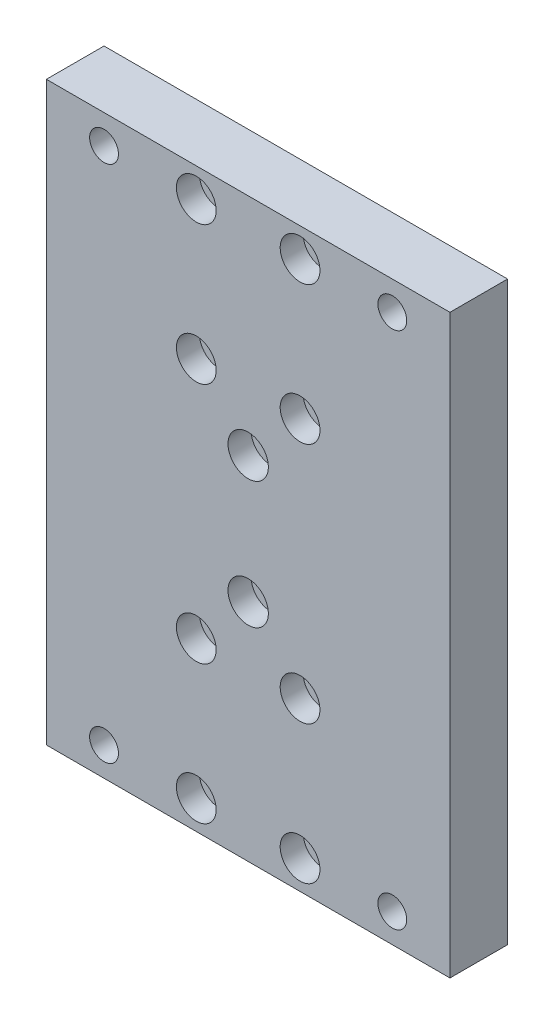
ISO-10303-21;
HEADER;
FILE_DESCRIPTION(('STEP AP214'),'2;1');
FILE_NAME('part.step','',(''),(''),'','','');
FILE_SCHEMA(('AUTOMOTIVE_DESIGN { 1 0 10303 214 1 1 1 1 }'));
ENDSEC;
DATA;
#1=APPLICATION_CONTEXT('core data for automotive mechanical design processes');
#2=APPLICATION_PROTOCOL_DEFINITION('international standard','automotive_design',2000,#1);
#3=PRODUCT_CONTEXT('',#1,'mechanical');
#4=PRODUCT('Part','Part','',(#3));
#5=PRODUCT_RELATED_PRODUCT_CATEGORY('part','',(#4));
#6=PRODUCT_DEFINITION_FORMATION('','',#4);
#7=PRODUCT_DEFINITION_CONTEXT('part definition',#1,'design');
#8=PRODUCT_DEFINITION('design','',#6,#7);
#9=PRODUCT_DEFINITION_SHAPE('','',#8);
#10=(LENGTH_UNIT() NAMED_UNIT(*) SI_UNIT(.MILLI.,.METRE.));
#11=(NAMED_UNIT(*) PLANE_ANGLE_UNIT() SI_UNIT($,.RADIAN.));
#12=(NAMED_UNIT(*) SI_UNIT($,.STERADIAN.) SOLID_ANGLE_UNIT());
#13=UNCERTAINTY_MEASURE_WITH_UNIT(LENGTH_MEASURE(1.E-05),#10,'distance_accuracy_value','');
#14=(GEOMETRIC_REPRESENTATION_CONTEXT(3) GLOBAL_UNCERTAINTY_ASSIGNED_CONTEXT((#13)) GLOBAL_UNIT_ASSIGNED_CONTEXT((#10,
#11,#12)) REPRESENTATION_CONTEXT('',''));
#15=CARTESIAN_POINT('',(0.,0.,0.));
#16=DIRECTION('',(0.,0.,1.));
#17=DIRECTION('',(1.,0.,0.));
#18=AXIS2_PLACEMENT_3D('',#15,#16,#17);
#19=CARTESIAN_POINT('',(0.,11.,0.));
#20=DIRECTION('',(0.,0.,1.));
#21=DIRECTION('',(1.,0.,0.));
#22=AXIS2_PLACEMENT_3D('',#19,#20,#21);
#23=CYLINDRICAL_SURFACE('',#22,2.);
#24=CARTESIAN_POINT('',(0.,11.,0.));
#25=DIRECTION('',(0.,0.,1.));
#26=DIRECTION('',(1.,0.,0.));
#27=AXIS2_PLACEMENT_3D('',#24,#25,#26);
#28=CIRCLE('',#27,2.);
#29=CARTESIAN_POINT('',(2.00000000000004,11.,0.));
#30=VERTEX_POINT('',#29);
#31=EDGE_CURVE('E143',#30,#30,#28,.T.);
#32=ORIENTED_EDGE('',*,*,#31,.F.);
#33=EDGE_LOOP('',(#32));
#34=FACE_BOUND('',#33,.T.);
#35=CARTESIAN_POINT('',(0.,11.,6.));
#36=DIRECTION('',(0.,0.,1.));
#37=DIRECTION('',(1.,0.,0.));
#38=AXIS2_PLACEMENT_3D('',#35,#36,#37);
#39=CIRCLE('',#38,2.);
#40=CARTESIAN_POINT('',(2.00000000000004,11.,6.));
#41=VERTEX_POINT('',#40);
#42=EDGE_CURVE('E40',#41,#41,#39,.F.);
#43=ORIENTED_EDGE('',*,*,#42,.F.);
#44=EDGE_LOOP('',(#43));
#45=FACE_BOUND('',#44,.T.);
#46=ADVANCED_FACE('F36',(#34,#45),#23,.F.);
#47=CARTESIAN_POINT('',(0.,-11.,0.));
#48=DIRECTION('',(0.,0.,1.));
#49=DIRECTION('',(1.,0.,0.));
#50=AXIS2_PLACEMENT_3D('',#47,#48,#49);
#51=CYLINDRICAL_SURFACE('',#50,2.);
#52=CARTESIAN_POINT('',(0.,-11.,0.));
#53=DIRECTION('',(0.,0.,1.));
#54=DIRECTION('',(1.,0.,0.));
#55=AXIS2_PLACEMENT_3D('',#52,#53,#54);
#56=CIRCLE('',#55,2.);
#57=CARTESIAN_POINT('',(1.99999999999997,-11.,0.));
#58=VERTEX_POINT('',#57);
#59=EDGE_CURVE('E158',#58,#58,#56,.T.);
#60=ORIENTED_EDGE('',*,*,#59,.F.);
#61=EDGE_LOOP('',(#60));
#62=FACE_BOUND('',#61,.T.);
#63=CARTESIAN_POINT('',(0.,-11.,6.));
#64=DIRECTION('',(0.,0.,1.));
#65=DIRECTION('',(1.,0.,0.));
#66=AXIS2_PLACEMENT_3D('',#63,#64,#65);
#67=CIRCLE('',#66,2.);
#68=CARTESIAN_POINT('',(1.99999999999997,-11.,6.));
#69=VERTEX_POINT('',#68);
#70=EDGE_CURVE('E137',#69,#69,#67,.F.);
#71=ORIENTED_EDGE('',*,*,#70,.F.);
#72=EDGE_LOOP('',(#71));
#73=FACE_BOUND('',#72,.T.);
#74=ADVANCED_FACE('F278',(#62,#73),#51,.F.);
#75=CARTESIAN_POINT('',(-9.00000000000006,-20.9999999999998,10.));
#76=DIRECTION('',(0.,0.,-1.));
#77=DIRECTION('',(-1.,0.,0.));
#78=AXIS2_PLACEMENT_3D('',#75,#76,#77);
#79=CYLINDRICAL_SURFACE('',#78,1.5);
#80=CARTESIAN_POINT('',(-9.00000000000006,-20.9999999999998,0.));
#81=DIRECTION('',(0.,0.,-1.));
#82=DIRECTION('',(-1.,0.,0.));
#83=AXIS2_PLACEMENT_3D('',#80,#81,#82);
#84=CIRCLE('',#83,1.5);
#85=CARTESIAN_POINT('',(-10.5000000000001,-20.9999999999998,0.));
#86=VERTEX_POINT('',#85);
#87=EDGE_CURVE('E213',#86,#86,#84,.T.);
#88=ORIENTED_EDGE('',*,*,#87,.T.);
#89=EDGE_LOOP('',(#88));
#90=FACE_BOUND('',#89,.T.);
#91=CARTESIAN_POINT('',(-9.00000000000006,-20.9999999999998,6.));
#92=DIRECTION('',(0.,0.,1.));
#93=DIRECTION('',(1.,0.,0.));
#94=AXIS2_PLACEMENT_3D('',#91,#92,#93);
#95=CIRCLE('',#94,1.5);
#96=CARTESIAN_POINT('',(-7.50000000000006,-20.9999999999998,6.));
#97=VERTEX_POINT('',#96);
#98=EDGE_CURVE('E131',#97,#97,#95,.F.);
#99=ORIENTED_EDGE('',*,*,#98,.F.);
#100=EDGE_LOOP('',(#99));
#101=FACE_BOUND('',#100,.T.);
#102=ADVANCED_FACE('F285',(#90,#101),#79,.F.);
#103=CARTESIAN_POINT('',(8.99999999999985,-44.9999999999998,10.));
#104=DIRECTION('',(0.,0.,-1.));
#105=DIRECTION('',(-1.,0.,0.));
#106=AXIS2_PLACEMENT_3D('',#103,#104,#105);
#107=CYLINDRICAL_SURFACE('',#106,1.5);
#108=CARTESIAN_POINT('',(8.99999999999985,-44.9999999999998,0.));
#109=DIRECTION('',(0.,0.,-1.));
#110=DIRECTION('',(-1.,0.,0.));
#111=AXIS2_PLACEMENT_3D('',#108,#109,#110);
#112=CIRCLE('',#111,1.5);
#113=CARTESIAN_POINT('',(7.49999999999985,-44.9999999999998,0.));
#114=VERTEX_POINT('',#113);
#115=EDGE_CURVE('E212',#114,#114,#112,.T.);
#116=ORIENTED_EDGE('',*,*,#115,.T.);
#117=EDGE_LOOP('',(#116));
#118=FACE_BOUND('',#117,.T.);
#119=CARTESIAN_POINT('',(8.99999999999985,-44.9999999999998,6.));
#120=DIRECTION('',(0.,0.,1.));
#121=DIRECTION('',(1.,0.,0.));
#122=AXIS2_PLACEMENT_3D('',#119,#120,#121);
#123=CIRCLE('',#122,1.5);
#124=CARTESIAN_POINT('',(10.4999999999998,-44.9999999999998,6.));
#125=VERTEX_POINT('',#124);
#126=EDGE_CURVE('E128',#125,#125,#123,.F.);
#127=ORIENTED_EDGE('',*,*,#126,.F.);
#128=EDGE_LOOP('',(#127));
#129=FACE_BOUND('',#128,.T.);
#130=ADVANCED_FACE('F366',(#118,#129),#107,.F.);
#131=CARTESIAN_POINT('',(-8.99999999999984,45.0000000000002,10.));
#132=DIRECTION('',(0.,0.,-1.));
#133=DIRECTION('',(-1.,0.,0.));
#134=AXIS2_PLACEMENT_3D('',#131,#132,#133);
#135=CYLINDRICAL_SURFACE('',#134,1.5);
#136=CARTESIAN_POINT('',(-8.99999999999984,45.0000000000002,0.));
#137=DIRECTION('',(0.,0.,-1.));
#138=DIRECTION('',(-1.,0.,0.));
#139=AXIS2_PLACEMENT_3D('',#136,#137,#138);
#140=CIRCLE('',#139,1.5);
#141=CARTESIAN_POINT('',(-10.4999999999998,45.0000000000002,0.));
#142=VERTEX_POINT('',#141);
#143=EDGE_CURVE('E225',#142,#142,#140,.T.);
#144=ORIENTED_EDGE('',*,*,#143,.T.);
#145=EDGE_LOOP('',(#144));
#146=FACE_BOUND('',#145,.T.);
#147=CARTESIAN_POINT('',(-8.99999999999984,45.0000000000002,6.));
#148=DIRECTION('',(0.,0.,1.));
#149=DIRECTION('',(1.,0.,0.));
#150=AXIS2_PLACEMENT_3D('',#147,#148,#149);
#151=CIRCLE('',#150,1.5);
#152=CARTESIAN_POINT('',(-7.49999999999983,45.0000000000002,6.));
#153=VERTEX_POINT('',#152);
#154=EDGE_CURVE('E122',#153,#153,#151,.F.);
#155=ORIENTED_EDGE('',*,*,#154,.F.);
#156=EDGE_LOOP('',(#155));
#157=FACE_BOUND('',#156,.T.);
#158=ADVANCED_FACE('F370',(#146,#157),#135,.F.);
#159=CARTESIAN_POINT('',(9.00000000000008,21.0000000000002,10.));
#160=DIRECTION('',(0.,0.,-1.));
#161=DIRECTION('',(-1.,0.,0.));
#162=AXIS2_PLACEMENT_3D('',#159,#160,#161);
#163=CYLINDRICAL_SURFACE('',#162,1.5);
#164=CARTESIAN_POINT('',(9.00000000000008,21.0000000000002,0.));
#165=DIRECTION('',(0.,0.,-1.));
#166=DIRECTION('',(-1.,0.,0.));
#167=AXIS2_PLACEMENT_3D('',#164,#165,#166);
#168=CIRCLE('',#167,1.5);
#169=CARTESIAN_POINT('',(7.50000000000007,21.0000000000002,0.));
#170=VERTEX_POINT('',#169);
#171=EDGE_CURVE('E222',#170,#170,#168,.T.);
#172=ORIENTED_EDGE('',*,*,#171,.T.);
#173=EDGE_LOOP('',(#172));
#174=FACE_BOUND('',#173,.T.);
#175=CARTESIAN_POINT('',(9.00000000000008,21.0000000000002,6.));
#176=DIRECTION('',(0.,0.,1.));
#177=DIRECTION('',(1.,0.,0.));
#178=AXIS2_PLACEMENT_3D('',#175,#176,#177);
#179=CIRCLE('',#178,1.5);
#180=CARTESIAN_POINT('',(10.5000000000001,21.0000000000002,6.));
#181=VERTEX_POINT('',#180);
#182=EDGE_CURVE('E119',#181,#181,#179,.F.);
#183=ORIENTED_EDGE('',*,*,#182,.F.);
#184=EDGE_LOOP('',(#183));
#185=FACE_BOUND('',#184,.T.);
#186=ADVANCED_FACE('F380',(#174,#185),#163,.F.);
#187=CARTESIAN_POINT('',(-35.,-50.,10.));
#188=DIRECTION('',(1.,0.,0.));
#189=DIRECTION('',(0.,0.,-1.));
#190=AXIS2_PLACEMENT_3D('',#187,#188,#189);
#191=PLANE('',#190);
#192=DIRECTION('',(0.,-1.,0.));
#193=VECTOR('',#192,1.);
#194=CARTESIAN_POINT('',(-35.,-50.,0.));
#195=LINE('',#194,#193);
#196=CARTESIAN_POINT('',(-35.,50.,0.));
#197=VERTEX_POINT('',#196);
#198=CARTESIAN_POINT('',(-35.,-50.,0.));
#199=VERTEX_POINT('',#198);
#200=EDGE_CURVE('E103',#197,#199,#195,.T.);
#201=ORIENTED_EDGE('',*,*,#200,.T.);
#202=DIRECTION('',(0.,0.,-1.));
#203=VECTOR('',#202,1.);
#204=CARTESIAN_POINT('',(-35.,-50.,10.));
#205=LINE('',#204,#203);
#206=CARTESIAN_POINT('',(-35.,-50.,10.));
#207=VERTEX_POINT('',#206);
#208=EDGE_CURVE('E11',#207,#199,#205,.T.);
#209=ORIENTED_EDGE('',*,*,#208,.F.);
#210=DIRECTION('',(0.,-1.,0.));
#211=VECTOR('',#210,1.);
#212=CARTESIAN_POINT('',(-35.,-50.,10.));
#213=LINE('',#212,#211);
#214=CARTESIAN_POINT('',(-35.,50.,10.));
#215=VERTEX_POINT('',#214);
#216=EDGE_CURVE('E90',#215,#207,#213,.T.);
#217=ORIENTED_EDGE('',*,*,#216,.F.);
#218=DIRECTION('',(0.,0.,-1.));
#219=VECTOR('',#218,1.);
#220=CARTESIAN_POINT('',(-35.,50.,10.));
#221=LINE('',#220,#219);
#222=EDGE_CURVE('E99',#215,#197,#221,.T.);
#223=ORIENTED_EDGE('',*,*,#222,.T.);
#224=EDGE_LOOP('',(#201,#209,#217,#223));
#225=FACE_BOUND('',#224,.T.);
#226=ADVANCED_FACE('F38',(#225),#191,.F.);
#227=CARTESIAN_POINT('',(35.,-50.,10.));
#228=DIRECTION('',(0.,1.,0.));
#229=DIRECTION('',(-1.,0.,0.));
#230=AXIS2_PLACEMENT_3D('',#227,#228,#229);
#231=PLANE('',#230);
#232=DIRECTION('',(1.,0.,0.));
#233=VECTOR('',#232,1.);
#234=CARTESIAN_POINT('',(35.,-50.,0.));
#235=LINE('',#234,#233);
#236=CARTESIAN_POINT('',(35.,-50.,0.));
#237=VERTEX_POINT('',#236);
#238=EDGE_CURVE('E94',#199,#237,#235,.T.);
#239=ORIENTED_EDGE('',*,*,#238,.T.);
#240=DIRECTION('',(0.,0.,-1.));
#241=VECTOR('',#240,1.);
#242=CARTESIAN_POINT('',(35.,-50.,10.));
#243=LINE('',#242,#241);
#244=CARTESIAN_POINT('',(35.,-50.,10.));
#245=VERTEX_POINT('',#244);
#246=EDGE_CURVE('E46',#245,#237,#243,.T.);
#247=ORIENTED_EDGE('',*,*,#246,.F.);
#248=DIRECTION('',(1.,0.,0.));
#249=VECTOR('',#248,1.);
#250=CARTESIAN_POINT('',(35.,-50.,10.));
#251=LINE('',#250,#249);
#252=EDGE_CURVE('E85',#207,#245,#251,.T.);
#253=ORIENTED_EDGE('',*,*,#252,.F.);
#254=ORIENTED_EDGE('',*,*,#208,.T.);
#255=EDGE_LOOP('',(#239,#247,#253,#254));
#256=FACE_BOUND('',#255,.T.);
#257=ADVANCED_FACE('F93',(#256),#231,.F.);
#258=CARTESIAN_POINT('',(35.,-50.,10.));
#259=DIRECTION('',(-1.,0.,0.));
#260=DIRECTION('',(0.,0.,1.));
#261=AXIS2_PLACEMENT_3D('',#258,#259,#260);
#262=PLANE('',#261);
#263=DIRECTION('',(0.,1.,0.));
#264=VECTOR('',#263,1.);
#265=CARTESIAN_POINT('',(35.,-50.,0.));
#266=LINE('',#265,#264);
#267=CARTESIAN_POINT('',(35.,50.,0.));
#268=VERTEX_POINT('',#267);
#269=EDGE_CURVE('E72',#237,#268,#266,.T.);
#270=ORIENTED_EDGE('',*,*,#269,.T.);
#271=DIRECTION('',(0.,0.,-1.));
#272=VECTOR('',#271,1.);
#273=CARTESIAN_POINT('',(35.,50.,10.));
#274=LINE('',#273,#272);
#275=CARTESIAN_POINT('',(35.,50.,10.));
#276=VERTEX_POINT('',#275);
#277=EDGE_CURVE('E95',#276,#268,#274,.T.);
#278=ORIENTED_EDGE('',*,*,#277,.F.);
#279=DIRECTION('',(0.,1.,0.));
#280=VECTOR('',#279,1.);
#281=CARTESIAN_POINT('',(35.,-50.,10.));
#282=LINE('',#281,#280);
#283=EDGE_CURVE('E88',#245,#276,#282,.T.);
#284=ORIENTED_EDGE('',*,*,#283,.F.);
#285=ORIENTED_EDGE('',*,*,#246,.T.);
#286=EDGE_LOOP('',(#270,#278,#284,#285));
#287=FACE_BOUND('',#286,.T.);
#288=ADVANCED_FACE('F97',(#287),#262,.F.);
#289=CARTESIAN_POINT('',(35.,50.,10.));
#290=DIRECTION('',(0.,-1.,0.));
#291=DIRECTION('',(0.,0.,-1.));
#292=AXIS2_PLACEMENT_3D('',#289,#290,#291);
#293=PLANE('',#292);
#294=DIRECTION('',(-1.,0.,0.));
#295=VECTOR('',#294,1.);
#296=CARTESIAN_POINT('',(35.,50.,0.));
#297=LINE('',#296,#295);
#298=EDGE_CURVE('E78',#268,#197,#297,.T.);
#299=ORIENTED_EDGE('',*,*,#298,.T.);
#300=ORIENTED_EDGE('',*,*,#222,.F.);
#301=DIRECTION('',(-1.,0.,0.));
#302=VECTOR('',#301,1.);
#303=CARTESIAN_POINT('',(35.,50.,10.));
#304=LINE('',#303,#302);
#305=EDGE_CURVE('E55',#276,#215,#304,.T.);
#306=ORIENTED_EDGE('',*,*,#305,.F.);
#307=ORIENTED_EDGE('',*,*,#277,.T.);
#308=EDGE_LOOP('',(#299,#300,#306,#307));
#309=FACE_BOUND('',#308,.T.);
#310=ADVANCED_FACE('F266',(#309),#293,.F.);
#311=CARTESIAN_POINT('',(0.,0.,10.));
#312=DIRECTION('',(0.,0.,1.));
#313=DIRECTION('',(1.,0.,0.));
#314=AXIS2_PLACEMENT_3D('',#311,#312,#313);
#315=PLANE('',#314);
#316=CARTESIAN_POINT('',(0.,11.,10.));
#317=DIRECTION('',(0.,0.,1.));
#318=DIRECTION('',(1.,0.,0.));
#319=AXIS2_PLACEMENT_3D('',#316,#317,#318);
#320=CIRCLE('',#319,3.5);
#321=CARTESIAN_POINT('',(3.50000000000004,11.,10.));
#322=VERTEX_POINT('',#321);
#323=EDGE_CURVE('E145',#322,#322,#320,.T.);
#324=ORIENTED_EDGE('',*,*,#323,.F.);
#325=EDGE_LOOP('',(#324));
#326=FACE_BOUND('',#325,.T.);
#327=CARTESIAN_POINT('',(0.,-11.,10.));
#328=DIRECTION('',(0.,0.,1.));
#329=DIRECTION('',(1.,0.,0.));
#330=AXIS2_PLACEMENT_3D('',#327,#328,#329);
#331=CIRCLE('',#330,3.5);
#332=CARTESIAN_POINT('',(3.49999999999997,-11.,10.));
#333=VERTEX_POINT('',#332);
#334=EDGE_CURVE('E155',#333,#333,#331,.T.);
#335=ORIENTED_EDGE('',*,*,#334,.F.);
#336=EDGE_LOOP('',(#335));
#337=FACE_BOUND('',#336,.T.);
#338=CARTESIAN_POINT('',(8.99999999999983,-21.,10.));
#339=DIRECTION('',(0.,0.,1.));
#340=DIRECTION('',(-1.,0.,0.));
#341=AXIS2_PLACEMENT_3D('',#338,#339,#340);
#342=CIRCLE('',#341,3.45);
#343=CARTESIAN_POINT('',(5.54999999999983,-21.,10.));
#344=VERTEX_POINT('',#343);
#345=EDGE_CURVE('E167',#344,#344,#342,.T.);
#346=ORIENTED_EDGE('',*,*,#345,.F.);
#347=EDGE_LOOP('',(#346));
#348=FACE_BOUND('',#347,.T.);
#349=CARTESIAN_POINT('',(8.99999999999984,45.0000000000002,10.));
#350=DIRECTION('',(0.,0.,1.));
#351=DIRECTION('',(-1.,0.,0.));
#352=AXIS2_PLACEMENT_3D('',#349,#350,#351);
#353=CIRCLE('',#352,3.45);
#354=CARTESIAN_POINT('',(5.54999999999984,45.0000000000002,10.));
#355=VERTEX_POINT('',#354);
#356=EDGE_CURVE('E186',#355,#355,#353,.T.);
#357=ORIENTED_EDGE('',*,*,#356,.F.);
#358=EDGE_LOOP('',(#357));
#359=FACE_BOUND('',#358,.T.);
#360=CARTESIAN_POINT('',(8.99999999999984,21.,10.));
#361=DIRECTION('',(0.,0.,1.));
#362=DIRECTION('',(1.,0.,0.));
#363=AXIS2_PLACEMENT_3D('',#360,#361,#362);
#364=CIRCLE('',#363,3.45);
#365=CARTESIAN_POINT('',(12.4499999999998,21.,10.));
#366=VERTEX_POINT('',#365);
#367=EDGE_CURVE('E185',#366,#366,#364,.T.);
#368=ORIENTED_EDGE('',*,*,#367,.F.);
#369=EDGE_LOOP('',(#368));
#370=FACE_BOUND('',#369,.T.);
#371=CARTESIAN_POINT('',(-8.99999999999984,21.,10.));
#372=DIRECTION('',(0.,0.,1.));
#373=DIRECTION('',(-1.,0.,0.));
#374=AXIS2_PLACEMENT_3D('',#371,#372,#373);
#375=CIRCLE('',#374,3.45);
#376=CARTESIAN_POINT('',(-12.4499999999998,21.,10.));
#377=VERTEX_POINT('',#376);
#378=EDGE_CURVE('E198',#377,#377,#375,.T.);
#379=ORIENTED_EDGE('',*,*,#378,.F.);
#380=EDGE_LOOP('',(#379));
#381=FACE_BOUND('',#380,.T.);
#382=CARTESIAN_POINT('',(-8.99999999999984,-21.,10.));
#383=DIRECTION('',(0.,0.,1.));
#384=DIRECTION('',(1.,0.,0.));
#385=AXIS2_PLACEMENT_3D('',#382,#383,#384);
#386=CIRCLE('',#385,3.45);
#387=CARTESIAN_POINT('',(-5.54999999999984,-21.,10.));
#388=VERTEX_POINT('',#387);
#389=EDGE_CURVE('E168',#388,#388,#386,.T.);
#390=ORIENTED_EDGE('',*,*,#389,.F.);
#391=EDGE_LOOP('',(#390));
#392=FACE_BOUND('',#391,.T.);
#393=CARTESIAN_POINT('',(-8.99999999999985,-45.0000000000002,10.));
#394=DIRECTION('',(0.,0.,1.));
#395=DIRECTION('',(-1.,0.,0.));
#396=AXIS2_PLACEMENT_3D('',#393,#394,#395);
#397=CIRCLE('',#396,3.45);
#398=CARTESIAN_POINT('',(-12.4499999999999,-45.0000000000002,10.));
#399=VERTEX_POINT('',#398);
#400=EDGE_CURVE('E174',#399,#399,#397,.T.);
#401=ORIENTED_EDGE('',*,*,#400,.F.);
#402=EDGE_LOOP('',(#401));
#403=FACE_BOUND('',#402,.T.);
#404=CARTESIAN_POINT('',(8.99999999999982,-45.0000000000002,10.));
#405=DIRECTION('',(0.,0.,1.));
#406=DIRECTION('',(1.,0.,0.));
#407=AXIS2_PLACEMENT_3D('',#404,#405,#406);
#408=CIRCLE('',#407,3.45);
#409=CARTESIAN_POINT('',(12.4499999999998,-45.0000000000002,10.));
#410=VERTEX_POINT('',#409);
#411=EDGE_CURVE('E161',#410,#410,#408,.T.);
#412=ORIENTED_EDGE('',*,*,#411,.F.);
#413=EDGE_LOOP('',(#412));
#414=FACE_BOUND('',#413,.T.);
#415=CARTESIAN_POINT('',(-8.99999999999984,45.0000000000002,10.));
#416=DIRECTION('',(0.,0.,1.));
#417=DIRECTION('',(1.,0.,0.));
#418=AXIS2_PLACEMENT_3D('',#415,#416,#417);
#419=CIRCLE('',#418,3.45);
#420=CARTESIAN_POINT('',(-5.54999999999984,45.0000000000002,10.));
#421=VERTEX_POINT('',#420);
#422=EDGE_CURVE('E197',#421,#421,#419,.T.);
#423=ORIENTED_EDGE('',*,*,#422,.F.);
#424=EDGE_LOOP('',(#423));
#425=FACE_BOUND('',#424,.T.);
#426=CARTESIAN_POINT('',(-25.,45.,10.));
#427=DIRECTION('',(0.,0.,-1.));
#428=DIRECTION('',(1.,0.,0.));
#429=AXIS2_PLACEMENT_3D('',#426,#427,#428);
#430=CIRCLE('',#429,2.5);
#431=CARTESIAN_POINT('',(-22.5,45.,10.));
#432=VERTEX_POINT('',#431);
#433=EDGE_CURVE('E240',#432,#432,#430,.T.);
#434=ORIENTED_EDGE('',*,*,#433,.T.);
#435=EDGE_LOOP('',(#434));
#436=FACE_BOUND('',#435,.T.);
#437=CARTESIAN_POINT('',(25.,-45.,10.));
#438=DIRECTION('',(0.,0.,-1.));
#439=DIRECTION('',(1.,0.,0.));
#440=AXIS2_PLACEMENT_3D('',#437,#438,#439);
#441=CIRCLE('',#440,2.5);
#442=CARTESIAN_POINT('',(27.5,-45.,10.));
#443=VERTEX_POINT('',#442);
#444=EDGE_CURVE('E247',#443,#443,#441,.T.);
#445=ORIENTED_EDGE('',*,*,#444,.T.);
#446=EDGE_LOOP('',(#445));
#447=FACE_BOUND('',#446,.T.);
#448=CARTESIAN_POINT('',(-25.,-45.,10.));
#449=DIRECTION('',(0.,0.,-1.));
#450=DIRECTION('',(-1.,0.,0.));
#451=AXIS2_PLACEMENT_3D('',#448,#449,#450);
#452=CIRCLE('',#451,2.5);
#453=CARTESIAN_POINT('',(-27.5,-45.,10.));
#454=VERTEX_POINT('',#453);
#455=EDGE_CURVE('E234',#454,#454,#452,.T.);
#456=ORIENTED_EDGE('',*,*,#455,.T.);
#457=EDGE_LOOP('',(#456));
#458=FACE_BOUND('',#457,.T.);
#459=CARTESIAN_POINT('',(25.,45.,10.));
#460=DIRECTION('',(0.,0.,-1.));
#461=DIRECTION('',(-1.,0.,0.));
#462=AXIS2_PLACEMENT_3D('',#459,#460,#461);
#463=CIRCLE('',#462,2.5);
#464=CARTESIAN_POINT('',(22.5,45.,10.));
#465=VERTEX_POINT('',#464);
#466=EDGE_CURVE('E106',#465,#465,#463,.T.);
#467=ORIENTED_EDGE('',*,*,#466,.T.);
#468=EDGE_LOOP('',(#467));
#469=FACE_BOUND('',#468,.T.);
#470=ORIENTED_EDGE('',*,*,#216,.T.);
#471=ORIENTED_EDGE('',*,*,#252,.T.);
#472=ORIENTED_EDGE('',*,*,#283,.T.);
#473=ORIENTED_EDGE('',*,*,#305,.T.);
#474=EDGE_LOOP('',(#470,#471,#472,#473));
#475=FACE_BOUND('',#474,.T.);
#476=ADVANCED_FACE('F86',(#326,#337,#348,#359,#370,#381,#392,#403,#414,#425,#436,#447,#458,#469,
#475),#315,.T.);
#477=CARTESIAN_POINT('',(0.,0.,0.));
#478=DIRECTION('',(0.,0.,1.));
#479=DIRECTION('',(1.,0.,0.));
#480=AXIS2_PLACEMENT_3D('',#477,#478,#479);
#481=PLANE('',#480);
#482=ORIENTED_EDGE('',*,*,#59,.T.);
#483=EDGE_LOOP('',(#482));
#484=FACE_BOUND('',#483,.T.);
#485=ORIENTED_EDGE('',*,*,#31,.T.);
#486=EDGE_LOOP('',(#485));
#487=FACE_BOUND('',#486,.T.);
#488=CARTESIAN_POINT('',(-9.00000000000015,-44.9999999999998,0.));
#489=DIRECTION('',(0.,0.,-1.));
#490=DIRECTION('',(-1.,0.,0.));
#491=AXIS2_PLACEMENT_3D('',#488,#489,#490);
#492=CIRCLE('',#491,1.5);
#493=CARTESIAN_POINT('',(-10.5000000000002,-44.9999999999998,0.));
#494=VERTEX_POINT('',#493);
#495=EDGE_CURVE('E216',#494,#494,#492,.T.);
#496=ORIENTED_EDGE('',*,*,#495,.F.);
#497=EDGE_LOOP('',(#496));
#498=FACE_BOUND('',#497,.T.);
#499=CARTESIAN_POINT('',(9.00000000000016,45.0000000000002,0.));
#500=DIRECTION('',(0.,0.,-1.));
#501=DIRECTION('',(-1.,0.,0.));
#502=AXIS2_PLACEMENT_3D('',#499,#500,#501);
#503=CIRCLE('',#502,1.5);
#504=CARTESIAN_POINT('',(7.50000000000016,45.0000000000002,0.));
#505=VERTEX_POINT('',#504);
#506=EDGE_CURVE('E219',#505,#505,#503,.T.);
#507=ORIENTED_EDGE('',*,*,#506,.F.);
#508=EDGE_LOOP('',(#507));
#509=FACE_BOUND('',#508,.T.);
#510=ORIENTED_EDGE('',*,*,#171,.F.);
#511=EDGE_LOOP('',(#510));
#512=FACE_BOUND('',#511,.T.);
#513=ORIENTED_EDGE('',*,*,#143,.F.);
#514=EDGE_LOOP('',(#513));
#515=FACE_BOUND('',#514,.T.);
#516=CARTESIAN_POINT('',(8.99999999999993,-20.9999999999998,0.));
#517=DIRECTION('',(0.,0.,-1.));
#518=DIRECTION('',(-1.,0.,0.));
#519=AXIS2_PLACEMENT_3D('',#516,#517,#518);
#520=CIRCLE('',#519,1.5);
#521=CARTESIAN_POINT('',(7.49999999999993,-20.9999999999998,0.));
#522=VERTEX_POINT('',#521);
#523=EDGE_CURVE('E136',#522,#522,#520,.T.);
#524=ORIENTED_EDGE('',*,*,#523,.F.);
#525=EDGE_LOOP('',(#524));
#526=FACE_BOUND('',#525,.T.);
#527=ORIENTED_EDGE('',*,*,#115,.F.);
#528=EDGE_LOOP('',(#527));
#529=FACE_BOUND('',#528,.T.);
#530=ORIENTED_EDGE('',*,*,#87,.F.);
#531=EDGE_LOOP('',(#530));
#532=FACE_BOUND('',#531,.T.);
#533=CARTESIAN_POINT('',(-8.99999999999992,21.0000000000002,0.));
#534=DIRECTION('',(0.,0.,-1.));
#535=DIRECTION('',(-1.,0.,0.));
#536=AXIS2_PLACEMENT_3D('',#533,#534,#535);
#537=CIRCLE('',#536,1.5);
#538=CARTESIAN_POINT('',(-10.4999999999999,21.0000000000002,0.));
#539=VERTEX_POINT('',#538);
#540=EDGE_CURVE('E228',#539,#539,#537,.T.);
#541=ORIENTED_EDGE('',*,*,#540,.F.);
#542=EDGE_LOOP('',(#541));
#543=FACE_BOUND('',#542,.T.);
#544=CARTESIAN_POINT('',(-25.,45.,0.));
#545=DIRECTION('',(0.,0.,-1.));
#546=DIRECTION('',(1.,0.,0.));
#547=AXIS2_PLACEMENT_3D('',#544,#545,#546);
#548=CIRCLE('',#547,2.5);
#549=CARTESIAN_POINT('',(-22.5,45.,0.));
#550=VERTEX_POINT('',#549);
#551=EDGE_CURVE('E244',#550,#550,#548,.T.);
#552=ORIENTED_EDGE('',*,*,#551,.F.);
#553=EDGE_LOOP('',(#552));
#554=FACE_BOUND('',#553,.T.);
#555=CARTESIAN_POINT('',(25.,-45.,0.));
#556=DIRECTION('',(0.,0.,-1.));
#557=DIRECTION('',(1.,0.,0.));
#558=AXIS2_PLACEMENT_3D('',#555,#556,#557);
#559=CIRCLE('',#558,2.5);
#560=CARTESIAN_POINT('',(27.5,-45.,0.));
#561=VERTEX_POINT('',#560);
#562=EDGE_CURVE('E237',#561,#561,#559,.T.);
#563=ORIENTED_EDGE('',*,*,#562,.F.);
#564=EDGE_LOOP('',(#563));
#565=FACE_BOUND('',#564,.T.);
#566=CARTESIAN_POINT('',(-25.,-45.,0.));
#567=DIRECTION('',(0.,0.,-1.));
#568=DIRECTION('',(-1.,0.,0.));
#569=AXIS2_PLACEMENT_3D('',#566,#567,#568);
#570=CIRCLE('',#569,2.5);
#571=CARTESIAN_POINT('',(-27.5,-45.,0.));
#572=VERTEX_POINT('',#571);
#573=EDGE_CURVE('E233',#572,#572,#570,.T.);
#574=ORIENTED_EDGE('',*,*,#573,.F.);
#575=EDGE_LOOP('',(#574));
#576=FACE_BOUND('',#575,.T.);
#577=CARTESIAN_POINT('',(25.,45.,0.));
#578=DIRECTION('',(0.,0.,-1.));
#579=DIRECTION('',(-1.,0.,0.));
#580=AXIS2_PLACEMENT_3D('',#577,#578,#579);
#581=CIRCLE('',#580,2.5);
#582=CARTESIAN_POINT('',(22.5,45.,0.));
#583=VERTEX_POINT('',#582);
#584=EDGE_CURVE('E243',#583,#583,#581,.T.);
#585=ORIENTED_EDGE('',*,*,#584,.F.);
#586=EDGE_LOOP('',(#585));
#587=FACE_BOUND('',#586,.T.);
#588=ORIENTED_EDGE('',*,*,#200,.F.);
#589=ORIENTED_EDGE('',*,*,#298,.F.);
#590=ORIENTED_EDGE('',*,*,#269,.F.);
#591=ORIENTED_EDGE('',*,*,#238,.F.);
#592=EDGE_LOOP('',(#588,#589,#590,#591));
#593=FACE_BOUND('',#592,.T.);
#594=ADVANCED_FACE('F259',(#484,#487,#498,#509,#512,#515,#526,#529,#532,#543,#554,#565,#576,
#587,#593),#481,.F.);
#595=CARTESIAN_POINT('',(25.,45.,10.));
#596=DIRECTION('',(0.,0.,-1.));
#597=DIRECTION('',(-1.,0.,0.));
#598=AXIS2_PLACEMENT_3D('',#595,#596,#597);
#599=CYLINDRICAL_SURFACE('',#598,2.5);
#600=ORIENTED_EDGE('',*,*,#466,.F.);
#601=EDGE_LOOP('',(#600));
#602=FACE_BOUND('',#601,.T.);
#603=ORIENTED_EDGE('',*,*,#584,.T.);
#604=EDGE_LOOP('',(#603));
#605=FACE_BOUND('',#604,.T.);
#606=ADVANCED_FACE('F257',(#602,#605),#599,.F.);
#607=CARTESIAN_POINT('',(-25.,-45.,10.));
#608=DIRECTION('',(0.,0.,-1.));
#609=DIRECTION('',(-1.,0.,0.));
#610=AXIS2_PLACEMENT_3D('',#607,#608,#609);
#611=CYLINDRICAL_SURFACE('',#610,2.5);
#612=ORIENTED_EDGE('',*,*,#455,.F.);
#613=EDGE_LOOP('',(#612));
#614=FACE_BOUND('',#613,.T.);
#615=ORIENTED_EDGE('',*,*,#573,.T.);
#616=EDGE_LOOP('',(#615));
#617=FACE_BOUND('',#616,.T.);
#618=ADVANCED_FACE('F389',(#614,#617),#611,.F.);
#619=CARTESIAN_POINT('',(25.,-45.,10.));
#620=DIRECTION('',(0.,0.,-1.));
#621=DIRECTION('',(-1.,0.,0.));
#622=AXIS2_PLACEMENT_3D('',#619,#620,#621);
#623=CYLINDRICAL_SURFACE('',#622,2.5);
#624=ORIENTED_EDGE('',*,*,#444,.F.);
#625=EDGE_LOOP('',(#624));
#626=FACE_BOUND('',#625,.T.);
#627=ORIENTED_EDGE('',*,*,#562,.T.);
#628=EDGE_LOOP('',(#627));
#629=FACE_BOUND('',#628,.T.);
#630=ADVANCED_FACE('F392',(#626,#629),#623,.F.);
#631=CARTESIAN_POINT('',(-25.,45.,10.));
#632=DIRECTION('',(0.,0.,-1.));
#633=DIRECTION('',(-1.,0.,0.));
#634=AXIS2_PLACEMENT_3D('',#631,#632,#633);
#635=CYLINDRICAL_SURFACE('',#634,2.5);
#636=ORIENTED_EDGE('',*,*,#433,.F.);
#637=EDGE_LOOP('',(#636));
#638=FACE_BOUND('',#637,.T.);
#639=ORIENTED_EDGE('',*,*,#551,.T.);
#640=EDGE_LOOP('',(#639));
#641=FACE_BOUND('',#640,.T.);
#642=ADVANCED_FACE('F387',(#638,#641),#635,.F.);
#643=CARTESIAN_POINT('',(-8.99999999999992,21.0000000000002,10.));
#644=DIRECTION('',(0.,0.,-1.));
#645=DIRECTION('',(-1.,0.,0.));
#646=AXIS2_PLACEMENT_3D('',#643,#644,#645);
#647=CYLINDRICAL_SURFACE('',#646,1.5);
#648=CARTESIAN_POINT('',(-8.99999999999992,21.0000000000002,6.));
#649=DIRECTION('',(0.,0.,-1.));
#650=DIRECTION('',(-1.,0.,0.));
#651=AXIS2_PLACEMENT_3D('',#648,#649,#650);
#652=CIRCLE('',#651,1.5);
#653=CARTESIAN_POINT('',(-10.4999999999999,21.0000000000002,6.));
#654=VERTEX_POINT('',#653);
#655=EDGE_CURVE('E134',#654,#654,#652,.F.);
#656=ORIENTED_EDGE('',*,*,#655,.T.);
#657=EDGE_LOOP('',(#656));
#658=FACE_BOUND('',#657,.T.);
#659=ORIENTED_EDGE('',*,*,#540,.T.);
#660=EDGE_LOOP('',(#659));
#661=FACE_BOUND('',#660,.T.);
#662=ADVANCED_FACE('F362',(#658,#661),#647,.F.);
#663=CARTESIAN_POINT('',(8.99999999999993,-20.9999999999998,10.));
#664=DIRECTION('',(0.,0.,-1.));
#665=DIRECTION('',(-1.,0.,0.));
#666=AXIS2_PLACEMENT_3D('',#663,#664,#665);
#667=CYLINDRICAL_SURFACE('',#666,1.5);
#668=CARTESIAN_POINT('',(8.99999999999993,-20.9999999999998,6.));
#669=DIRECTION('',(0.,0.,-1.));
#670=DIRECTION('',(-1.,0.,0.));
#671=AXIS2_PLACEMENT_3D('',#668,#669,#670);
#672=CIRCLE('',#671,1.5);
#673=CARTESIAN_POINT('',(7.49999999999993,-20.9999999999998,6.));
#674=VERTEX_POINT('',#673);
#675=EDGE_CURVE('E125',#674,#674,#672,.F.);
#676=ORIENTED_EDGE('',*,*,#675,.T.);
#677=EDGE_LOOP('',(#676));
#678=FACE_BOUND('',#677,.T.);
#679=ORIENTED_EDGE('',*,*,#523,.T.);
#680=EDGE_LOOP('',(#679));
#681=FACE_BOUND('',#680,.T.);
#682=ADVANCED_FACE('F358',(#678,#681),#667,.F.);
#683=CARTESIAN_POINT('',(9.00000000000016,45.0000000000002,10.));
#684=DIRECTION('',(0.,0.,-1.));
#685=DIRECTION('',(-1.,0.,0.));
#686=AXIS2_PLACEMENT_3D('',#683,#684,#685);
#687=CYLINDRICAL_SURFACE('',#686,1.5);
#688=CARTESIAN_POINT('',(9.00000000000016,45.0000000000002,6.));
#689=DIRECTION('',(0.,0.,-1.));
#690=DIRECTION('',(-1.,0.,0.));
#691=AXIS2_PLACEMENT_3D('',#688,#689,#690);
#692=CIRCLE('',#691,1.5);
#693=CARTESIAN_POINT('',(7.50000000000016,45.0000000000002,6.));
#694=VERTEX_POINT('',#693);
#695=EDGE_CURVE('E115',#694,#694,#692,.F.);
#696=ORIENTED_EDGE('',*,*,#695,.T.);
#697=EDGE_LOOP('',(#696));
#698=FACE_BOUND('',#697,.T.);
#699=ORIENTED_EDGE('',*,*,#506,.T.);
#700=EDGE_LOOP('',(#699));
#701=FACE_BOUND('',#700,.T.);
#702=ADVANCED_FACE('F361',(#698,#701),#687,.F.);
#703=CARTESIAN_POINT('',(-9.00000000000015,-44.9999999999998,10.));
#704=DIRECTION('',(0.,0.,-1.));
#705=DIRECTION('',(-1.,0.,0.));
#706=AXIS2_PLACEMENT_3D('',#703,#704,#705);
#707=CYLINDRICAL_SURFACE('',#706,1.5);
#708=CARTESIAN_POINT('',(-9.00000000000015,-44.9999999999998,6.));
#709=DIRECTION('',(0.,0.,-1.));
#710=DIRECTION('',(-1.,0.,0.));
#711=AXIS2_PLACEMENT_3D('',#708,#709,#710);
#712=CIRCLE('',#711,1.5);
#713=CARTESIAN_POINT('',(-10.5000000000002,-44.9999999999998,6.));
#714=VERTEX_POINT('',#713);
#715=EDGE_CURVE('E112',#714,#714,#712,.F.);
#716=ORIENTED_EDGE('',*,*,#715,.T.);
#717=EDGE_LOOP('',(#716));
#718=FACE_BOUND('',#717,.T.);
#719=ORIENTED_EDGE('',*,*,#495,.T.);
#720=EDGE_LOOP('',(#719));
#721=FACE_BOUND('',#720,.T.);
#722=ADVANCED_FACE('F306',(#718,#721),#707,.F.);
#723=CARTESIAN_POINT('',(-8.99999999999985,-45.0000000000002,6.));
#724=DIRECTION('',(0.,0.,-1.));
#725=DIRECTION('',(-1.,0.,0.));
#726=AXIS2_PLACEMENT_3D('',#723,#724,#725);
#727=PLANE('',#726);
#728=CARTESIAN_POINT('',(-8.99999999999985,-45.0000000000002,6.));
#729=DIRECTION('',(0.,0.,1.));
#730=DIRECTION('',(-1.,0.,0.));
#731=AXIS2_PLACEMENT_3D('',#728,#729,#730);
#732=CIRCLE('',#731,3.45);
#733=CARTESIAN_POINT('',(-12.4499999999999,-45.0000000000002,6.));
#734=VERTEX_POINT('',#733);
#735=EDGE_CURVE('E171',#734,#734,#732,.T.);
#736=ORIENTED_EDGE('',*,*,#735,.T.);
#737=EDGE_LOOP('',(#736));
#738=FACE_BOUND('',#737,.T.);
#739=ORIENTED_EDGE('',*,*,#715,.F.);
#740=EDGE_LOOP('',(#739));
#741=FACE_BOUND('',#740,.T.);
#742=ADVANCED_FACE('F302',(#738,#741),#727,.F.);
#743=CARTESIAN_POINT('',(-8.99999999999985,-45.0000000000002,6.));
#744=DIRECTION('',(0.,0.,1.));
#745=DIRECTION('',(1.,0.,0.));
#746=AXIS2_PLACEMENT_3D('',#743,#744,#745);
#747=CYLINDRICAL_SURFACE('',#746,3.45);
#748=ORIENTED_EDGE('',*,*,#735,.F.);
#749=EDGE_LOOP('',(#748));
#750=FACE_BOUND('',#749,.T.);
#751=ORIENTED_EDGE('',*,*,#400,.T.);
#752=EDGE_LOOP('',(#751));
#753=FACE_BOUND('',#752,.T.);
#754=ADVANCED_FACE('F305',(#750,#753),#747,.F.);
#755=CARTESIAN_POINT('',(8.99999999999984,45.0000000000002,6.));
#756=DIRECTION('',(0.,0.,-1.));
#757=DIRECTION('',(-1.,0.,0.));
#758=AXIS2_PLACEMENT_3D('',#755,#756,#757);
#759=PLANE('',#758);
#760=CARTESIAN_POINT('',(8.99999999999984,45.0000000000002,6.));
#761=DIRECTION('',(0.,0.,1.));
#762=DIRECTION('',(-1.,0.,0.));
#763=AXIS2_PLACEMENT_3D('',#760,#761,#762);
#764=CIRCLE('',#763,3.45);
#765=CARTESIAN_POINT('',(5.54999999999984,45.0000000000002,6.));
#766=VERTEX_POINT('',#765);
#767=EDGE_CURVE('E182',#766,#766,#764,.T.);
#768=ORIENTED_EDGE('',*,*,#767,.T.);
#769=EDGE_LOOP('',(#768));
#770=FACE_BOUND('',#769,.T.);
#771=ORIENTED_EDGE('',*,*,#695,.F.);
#772=EDGE_LOOP('',(#771));
#773=FACE_BOUND('',#772,.T.);
#774=ADVANCED_FACE('F310',(#770,#773),#759,.F.);
#775=CARTESIAN_POINT('',(8.99999999999984,45.0000000000002,6.));
#776=DIRECTION('',(0.,0.,1.));
#777=DIRECTION('',(1.,0.,0.));
#778=AXIS2_PLACEMENT_3D('',#775,#776,#777);
#779=CYLINDRICAL_SURFACE('',#778,3.45);
#780=ORIENTED_EDGE('',*,*,#767,.F.);
#781=EDGE_LOOP('',(#780));
#782=FACE_BOUND('',#781,.T.);
#783=ORIENTED_EDGE('',*,*,#356,.T.);
#784=EDGE_LOOP('',(#783));
#785=FACE_BOUND('',#784,.T.);
#786=ADVANCED_FACE('F322',(#782,#785),#779,.F.);
#787=CARTESIAN_POINT('',(8.99999999999984,21.,6.));
#788=DIRECTION('',(0.,0.,1.));
#789=DIRECTION('',(1.,0.,0.));
#790=AXIS2_PLACEMENT_3D('',#787,#788,#789);
#791=PLANE('',#790);
#792=CARTESIAN_POINT('',(8.99999999999984,21.,6.));
#793=DIRECTION('',(0.,0.,1.));
#794=DIRECTION('',(1.,0.,0.));
#795=AXIS2_PLACEMENT_3D('',#792,#793,#794);
#796=CIRCLE('',#795,3.45);
#797=CARTESIAN_POINT('',(12.4499999999998,21.,6.));
#798=VERTEX_POINT('',#797);
#799=EDGE_CURVE('E201',#798,#798,#796,.T.);
#800=ORIENTED_EDGE('',*,*,#799,.T.);
#801=EDGE_LOOP('',(#800));
#802=FACE_BOUND('',#801,.T.);
#803=ORIENTED_EDGE('',*,*,#182,.T.);
#804=EDGE_LOOP('',(#803));
#805=FACE_BOUND('',#804,.T.);
#806=ADVANCED_FACE('F326',(#802,#805),#791,.T.);
#807=CARTESIAN_POINT('',(8.99999999999984,21.,6.));
#808=DIRECTION('',(0.,0.,1.));
#809=DIRECTION('',(1.,0.,0.));
#810=AXIS2_PLACEMENT_3D('',#807,#808,#809);
#811=CYLINDRICAL_SURFACE('',#810,3.45);
#812=ORIENTED_EDGE('',*,*,#799,.F.);
#813=EDGE_LOOP('',(#812));
#814=FACE_BOUND('',#813,.T.);
#815=ORIENTED_EDGE('',*,*,#367,.T.);
#816=EDGE_LOOP('',(#815));
#817=FACE_BOUND('',#816,.T.);
#818=ADVANCED_FACE('F346',(#814,#817),#811,.F.);
#819=CARTESIAN_POINT('',(-8.99999999999984,45.0000000000002,6.));
#820=DIRECTION('',(0.,0.,1.));
#821=DIRECTION('',(1.,0.,0.));
#822=AXIS2_PLACEMENT_3D('',#819,#820,#821);
#823=PLANE('',#822);
#824=CARTESIAN_POINT('',(-8.99999999999984,45.0000000000002,6.));
#825=DIRECTION('',(0.,0.,1.));
#826=DIRECTION('',(1.,0.,0.));
#827=AXIS2_PLACEMENT_3D('',#824,#825,#826);
#828=CIRCLE('',#827,3.45);
#829=CARTESIAN_POINT('',(-5.54999999999984,45.0000000000002,6.));
#830=VERTEX_POINT('',#829);
#831=EDGE_CURVE('E116',#830,#830,#828,.T.);
#832=ORIENTED_EDGE('',*,*,#831,.T.);
#833=EDGE_LOOP('',(#832));
#834=FACE_BOUND('',#833,.T.);
#835=ORIENTED_EDGE('',*,*,#154,.T.);
#836=EDGE_LOOP('',(#835));
#837=FACE_BOUND('',#836,.T.);
#838=ADVANCED_FACE('F350',(#834,#837),#823,.T.);
#839=CARTESIAN_POINT('',(-8.99999999999984,45.0000000000002,6.));
#840=DIRECTION('',(0.,0.,1.));
#841=DIRECTION('',(1.,0.,0.));
#842=AXIS2_PLACEMENT_3D('',#839,#840,#841);
#843=CYLINDRICAL_SURFACE('',#842,3.45);
#844=ORIENTED_EDGE('',*,*,#831,.F.);
#845=EDGE_LOOP('',(#844));
#846=FACE_BOUND('',#845,.T.);
#847=ORIENTED_EDGE('',*,*,#422,.T.);
#848=EDGE_LOOP('',(#847));
#849=FACE_BOUND('',#848,.T.);
#850=ADVANCED_FACE('F331',(#846,#849),#843,.F.);
#851=CARTESIAN_POINT('',(8.99999999999983,-21.,6.));
#852=DIRECTION('',(0.,0.,-1.));
#853=DIRECTION('',(-1.,0.,0.));
#854=AXIS2_PLACEMENT_3D('',#851,#852,#853);
#855=PLANE('',#854);
#856=CARTESIAN_POINT('',(8.99999999999983,-21.,6.));
#857=DIRECTION('',(0.,0.,1.));
#858=DIRECTION('',(-1.,0.,0.));
#859=AXIS2_PLACEMENT_3D('',#856,#857,#858);
#860=CIRCLE('',#859,3.45);
#861=CARTESIAN_POINT('',(5.54999999999983,-21.,6.));
#862=VERTEX_POINT('',#861);
#863=EDGE_CURVE('E189',#862,#862,#860,.T.);
#864=ORIENTED_EDGE('',*,*,#863,.T.);
#865=EDGE_LOOP('',(#864));
#866=FACE_BOUND('',#865,.T.);
#867=ORIENTED_EDGE('',*,*,#675,.F.);
#868=EDGE_LOOP('',(#867));
#869=FACE_BOUND('',#868,.T.);
#870=ADVANCED_FACE('F328',(#866,#869),#855,.F.);
#871=CARTESIAN_POINT('',(8.99999999999983,-21.,6.));
#872=DIRECTION('',(0.,0.,1.));
#873=DIRECTION('',(1.,0.,0.));
#874=AXIS2_PLACEMENT_3D('',#871,#872,#873);
#875=CYLINDRICAL_SURFACE('',#874,3.45);
#876=ORIENTED_EDGE('',*,*,#863,.F.);
#877=EDGE_LOOP('',(#876));
#878=FACE_BOUND('',#877,.T.);
#879=ORIENTED_EDGE('',*,*,#345,.T.);
#880=EDGE_LOOP('',(#879));
#881=FACE_BOUND('',#880,.T.);
#882=ADVANCED_FACE('F315',(#878,#881),#875,.F.);
#883=CARTESIAN_POINT('',(8.99999999999982,-45.0000000000002,6.));
#884=DIRECTION('',(0.,0.,1.));
#885=DIRECTION('',(1.,0.,0.));
#886=AXIS2_PLACEMENT_3D('',#883,#884,#885);
#887=PLANE('',#886);
#888=CARTESIAN_POINT('',(8.99999999999982,-45.0000000000002,6.));
#889=DIRECTION('',(0.,0.,1.));
#890=DIRECTION('',(1.,0.,0.));
#891=AXIS2_PLACEMENT_3D('',#888,#889,#890);
#892=CIRCLE('',#891,3.45);
#893=CARTESIAN_POINT('',(12.4499999999998,-45.0000000000002,6.));
#894=VERTEX_POINT('',#893);
#895=EDGE_CURVE('E177',#894,#894,#892,.T.);
#896=ORIENTED_EDGE('',*,*,#895,.T.);
#897=EDGE_LOOP('',(#896));
#898=FACE_BOUND('',#897,.T.);
#899=ORIENTED_EDGE('',*,*,#126,.T.);
#900=EDGE_LOOP('',(#899));
#901=FACE_BOUND('',#900,.T.);
#902=ADVANCED_FACE('F312',(#898,#901),#887,.T.);
#903=CARTESIAN_POINT('',(8.99999999999982,-45.0000000000002,6.));
#904=DIRECTION('',(0.,0.,1.));
#905=DIRECTION('',(1.,0.,0.));
#906=AXIS2_PLACEMENT_3D('',#903,#904,#905);
#907=CYLINDRICAL_SURFACE('',#906,3.45);
#908=ORIENTED_EDGE('',*,*,#895,.F.);
#909=EDGE_LOOP('',(#908));
#910=FACE_BOUND('',#909,.T.);
#911=ORIENTED_EDGE('',*,*,#411,.T.);
#912=EDGE_LOOP('',(#911));
#913=FACE_BOUND('',#912,.T.);
#914=ADVANCED_FACE('F296',(#910,#913),#907,.F.);
#915=CARTESIAN_POINT('',(-8.99999999999984,-21.,6.));
#916=DIRECTION('',(0.,0.,1.));
#917=DIRECTION('',(1.,0.,0.));
#918=AXIS2_PLACEMENT_3D('',#915,#916,#917);
#919=PLANE('',#918);
#920=CARTESIAN_POINT('',(-8.99999999999984,-21.,6.));
#921=DIRECTION('',(0.,0.,1.));
#922=DIRECTION('',(1.,0.,0.));
#923=AXIS2_PLACEMENT_3D('',#920,#921,#922);
#924=CIRCLE('',#923,3.45);
#925=CARTESIAN_POINT('',(-5.54999999999984,-21.,6.));
#926=VERTEX_POINT('',#925);
#927=EDGE_CURVE('E164',#926,#926,#924,.T.);
#928=ORIENTED_EDGE('',*,*,#927,.T.);
#929=EDGE_LOOP('',(#928));
#930=FACE_BOUND('',#929,.T.);
#931=ORIENTED_EDGE('',*,*,#98,.T.);
#932=EDGE_LOOP('',(#931));
#933=FACE_BOUND('',#932,.T.);
#934=ADVANCED_FACE('F292',(#930,#933),#919,.T.);
#935=CARTESIAN_POINT('',(-8.99999999999984,-21.,6.));
#936=DIRECTION('',(0.,0.,1.));
#937=DIRECTION('',(1.,0.,0.));
#938=AXIS2_PLACEMENT_3D('',#935,#936,#937);
#939=CYLINDRICAL_SURFACE('',#938,3.45);
#940=ORIENTED_EDGE('',*,*,#927,.F.);
#941=EDGE_LOOP('',(#940));
#942=FACE_BOUND('',#941,.T.);
#943=ORIENTED_EDGE('',*,*,#389,.T.);
#944=EDGE_LOOP('',(#943));
#945=FACE_BOUND('',#944,.T.);
#946=ADVANCED_FACE('F295',(#942,#945),#939,.F.);
#947=CARTESIAN_POINT('',(-8.99999999999984,21.,6.));
#948=DIRECTION('',(0.,0.,-1.));
#949=DIRECTION('',(-1.,0.,0.));
#950=AXIS2_PLACEMENT_3D('',#947,#948,#949);
#951=PLANE('',#950);
#952=CARTESIAN_POINT('',(-8.99999999999984,21.,6.));
#953=DIRECTION('',(0.,0.,1.));
#954=DIRECTION('',(-1.,0.,0.));
#955=AXIS2_PLACEMENT_3D('',#952,#953,#954);
#956=CIRCLE('',#955,3.45);
#957=CARTESIAN_POINT('',(-12.4499999999998,21.,6.));
#958=VERTEX_POINT('',#957);
#959=EDGE_CURVE('E194',#958,#958,#956,.T.);
#960=ORIENTED_EDGE('',*,*,#959,.T.);
#961=EDGE_LOOP('',(#960));
#962=FACE_BOUND('',#961,.T.);
#963=ORIENTED_EDGE('',*,*,#655,.F.);
#964=EDGE_LOOP('',(#963));
#965=FACE_BOUND('',#964,.T.);
#966=ADVANCED_FACE('F300',(#962,#965),#951,.F.);
#967=CARTESIAN_POINT('',(-8.99999999999984,21.,6.));
#968=DIRECTION('',(0.,0.,1.));
#969=DIRECTION('',(1.,0.,0.));
#970=AXIS2_PLACEMENT_3D('',#967,#968,#969);
#971=CYLINDRICAL_SURFACE('',#970,3.45);
#972=ORIENTED_EDGE('',*,*,#959,.F.);
#973=EDGE_LOOP('',(#972));
#974=FACE_BOUND('',#973,.T.);
#975=ORIENTED_EDGE('',*,*,#378,.T.);
#976=EDGE_LOOP('',(#975));
#977=FACE_BOUND('',#976,.T.);
#978=ADVANCED_FACE('F338',(#974,#977),#971,.F.);
#979=CARTESIAN_POINT('',(0.,-11.,6.));
#980=DIRECTION('',(0.,0.,1.));
#981=DIRECTION('',(1.,0.,0.));
#982=AXIS2_PLACEMENT_3D('',#979,#980,#981);
#983=PLANE('',#982);
#984=CARTESIAN_POINT('',(0.,-11.,6.));
#985=DIRECTION('',(0.,0.,1.));
#986=DIRECTION('',(1.,0.,0.));
#987=AXIS2_PLACEMENT_3D('',#984,#985,#986);
#988=CIRCLE('',#987,3.5);
#989=CARTESIAN_POINT('',(3.49999999999997,-11.,6.));
#990=VERTEX_POINT('',#989);
#991=EDGE_CURVE('E150',#990,#990,#988,.T.);
#992=ORIENTED_EDGE('',*,*,#991,.T.);
#993=EDGE_LOOP('',(#992));
#994=FACE_BOUND('',#993,.T.);
#995=ORIENTED_EDGE('',*,*,#70,.T.);
#996=EDGE_LOOP('',(#995));
#997=FACE_BOUND('',#996,.T.);
#998=ADVANCED_FACE('F342',(#994,#997),#983,.T.);
#999=CARTESIAN_POINT('',(0.,-11.,6.));
#1000=DIRECTION('',(0.,0.,1.));
#1001=DIRECTION('',(1.,0.,0.));
#1002=AXIS2_PLACEMENT_3D('',#999,#1000,#1001);
#1003=CYLINDRICAL_SURFACE('',#1002,3.5);
#1004=ORIENTED_EDGE('',*,*,#991,.F.);
#1005=EDGE_LOOP('',(#1004));
#1006=FACE_BOUND('',#1005,.T.);
#1007=ORIENTED_EDGE('',*,*,#334,.T.);
#1008=EDGE_LOOP('',(#1007));
#1009=FACE_BOUND('',#1008,.T.);
#1010=ADVANCED_FACE('F517',(#1006,#1009),#1003,.F.);
#1011=CARTESIAN_POINT('',(0.,11.,6.));
#1012=DIRECTION('',(0.,0.,1.));
#1013=DIRECTION('',(1.,0.,0.));
#1014=AXIS2_PLACEMENT_3D('',#1011,#1012,#1013);
#1015=PLANE('',#1014);
#1016=CARTESIAN_POINT('',(0.,11.,6.));
#1017=DIRECTION('',(0.,0.,1.));
#1018=DIRECTION('',(1.,0.,0.));
#1019=AXIS2_PLACEMENT_3D('',#1016,#1017,#1018);
#1020=CIRCLE('',#1019,3.5);
#1021=CARTESIAN_POINT('',(3.50000000000004,11.,6.));
#1022=VERTEX_POINT('',#1021);
#1023=EDGE_CURVE('E139',#1022,#1022,#1020,.T.);
#1024=ORIENTED_EDGE('',*,*,#1023,.T.);
#1025=EDGE_LOOP('',(#1024));
#1026=FACE_BOUND('',#1025,.T.);
#1027=ORIENTED_EDGE('',*,*,#42,.T.);
#1028=EDGE_LOOP('',(#1027));
#1029=FACE_BOUND('',#1028,.T.);
#1030=ADVANCED_FACE('F524',(#1026,#1029),#1015,.T.);
#1031=CARTESIAN_POINT('',(0.,11.,6.));
#1032=DIRECTION('',(0.,0.,1.));
#1033=DIRECTION('',(1.,0.,0.));
#1034=AXIS2_PLACEMENT_3D('',#1031,#1032,#1033);
#1035=CYLINDRICAL_SURFACE('',#1034,3.5);
#1036=ORIENTED_EDGE('',*,*,#1023,.F.);
#1037=EDGE_LOOP('',(#1036));
#1038=FACE_BOUND('',#1037,.T.);
#1039=ORIENTED_EDGE('',*,*,#323,.T.);
#1040=EDGE_LOOP('',(#1039));
#1041=FACE_BOUND('',#1040,.T.);
#1042=ADVANCED_FACE('F531',(#1038,#1041),#1035,.F.);
#1043=CLOSED_SHELL('',(#46,#74,#102,#130,#158,#186,#226,#257,#288,#310,#476,#594,#606,#618,#630,
#642,#662,#682,#702,#722,#742,#754,#774,#786,#806,#818,#838,#850,#870,#882,#902,#914,#934,#946,
#966,#978,#998,#1010,#1030,#1042));
#1044=MANIFOLD_SOLID_BREP('B2',#1043);
#1045=ADVANCED_BREP_SHAPE_REPRESENTATION('',(#18,#1044),#14);
#1046=SHAPE_DEFINITION_REPRESENTATION(#9,#1045);
ENDSEC;
END-ISO-10303-21;
